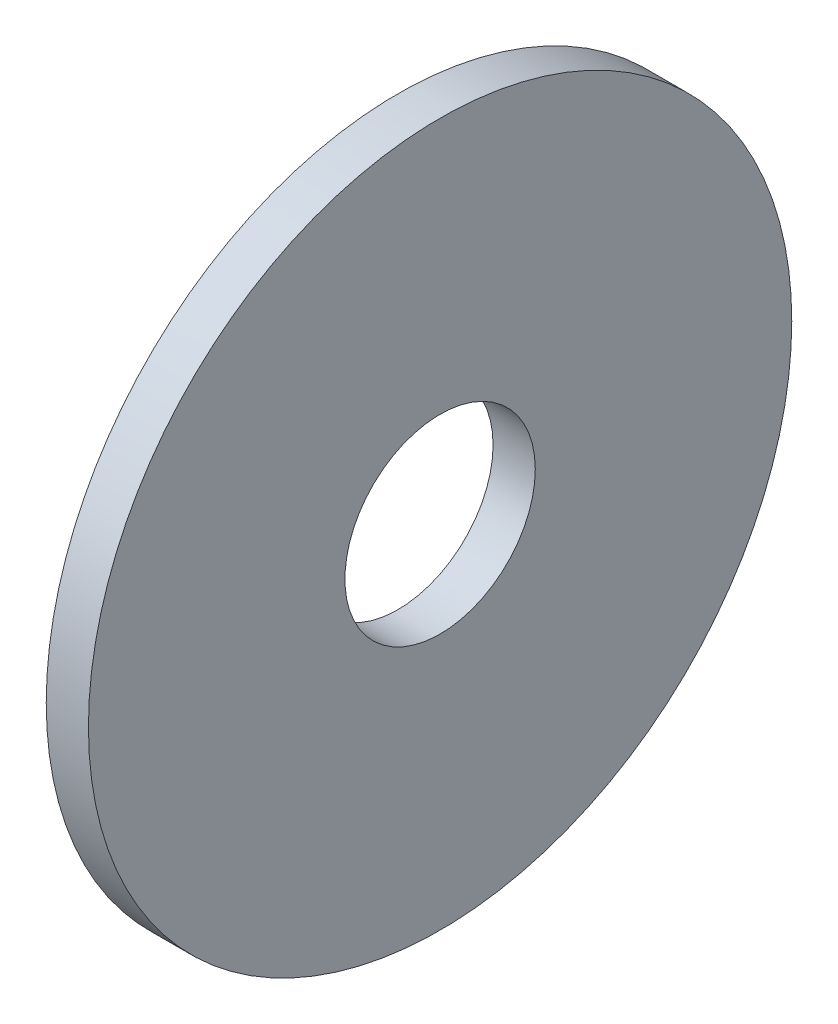
ISO-10303-21;
HEADER;
FILE_DESCRIPTION(('STEP AP214'),'2;1');
FILE_NAME('part.step','',(''),(''),'','','');
FILE_SCHEMA(('AUTOMOTIVE_DESIGN { 1 0 10303 214 1 1 1 1 }'));
ENDSEC;
DATA;
#1=APPLICATION_CONTEXT('core data for automotive mechanical design processes');
#2=APPLICATION_PROTOCOL_DEFINITION('international standard','automotive_design',2000,#1);
#3=PRODUCT_CONTEXT('',#1,'mechanical');
#4=PRODUCT('Part','Part','',(#3));
#5=PRODUCT_RELATED_PRODUCT_CATEGORY('part','',(#4));
#6=PRODUCT_DEFINITION_FORMATION('','',#4);
#7=PRODUCT_DEFINITION_CONTEXT('part definition',#1,'design');
#8=PRODUCT_DEFINITION('design','',#6,#7);
#9=PRODUCT_DEFINITION_SHAPE('','',#8);
#10=(LENGTH_UNIT() NAMED_UNIT(*) SI_UNIT(.MILLI.,.METRE.));
#11=(NAMED_UNIT(*) PLANE_ANGLE_UNIT() SI_UNIT($,.RADIAN.));
#12=(NAMED_UNIT(*) SI_UNIT($,.STERADIAN.) SOLID_ANGLE_UNIT());
#13=UNCERTAINTY_MEASURE_WITH_UNIT(LENGTH_MEASURE(1.E-05),#10,'distance_accuracy_value','');
#14=(GEOMETRIC_REPRESENTATION_CONTEXT(3) GLOBAL_UNCERTAINTY_ASSIGNED_CONTEXT((#13)) GLOBAL_UNIT_ASSIGNED_CONTEXT((#10,
#11,#12)) REPRESENTATION_CONTEXT('',''));
#15=CARTESIAN_POINT('',(0.,0.,0.));
#16=DIRECTION('',(0.,0.,1.));
#17=DIRECTION('',(1.,0.,0.));
#18=AXIS2_PLACEMENT_3D('',#15,#16,#17);
#19=CARTESIAN_POINT('',(1.143,0.,0.));
#20=DIRECTION('',(1.,0.,0.));
#21=DIRECTION('',(0.,0.,-1.));
#22=AXIS2_PLACEMENT_3D('',#19,#20,#21);
#23=PLANE('',#22);
#24=CARTESIAN_POINT('',(1.143,0.,0.));
#25=DIRECTION('',(1.,0.,0.));
#26=DIRECTION('',(0.,0.,-1.));
#27=AXIS2_PLACEMENT_3D('',#24,#25,#26);
#28=CIRCLE('',#27,9.525);
#29=CARTESIAN_POINT('',(1.143,0.,-9.525));
#30=VERTEX_POINT('',#29);
#31=EDGE_CURVE('E10',#30,#30,#28,.T.);
#32=ORIENTED_EDGE('',*,*,#31,.T.);
#33=EDGE_LOOP('',(#32));
#34=FACE_BOUND('',#33,.T.);
#35=CARTESIAN_POINT('',(1.143,0.,0.));
#36=DIRECTION('',(1.,0.,0.));
#37=DIRECTION('',(0.,0.,-1.));
#38=AXIS2_PLACEMENT_3D('',#35,#36,#37);
#39=CIRCLE('',#38,2.5781);
#40=CARTESIAN_POINT('',(1.143,0.,-2.5781));
#41=VERTEX_POINT('',#40);
#42=EDGE_CURVE('E41',#41,#41,#39,.T.);
#43=ORIENTED_EDGE('',*,*,#42,.F.);
#44=EDGE_LOOP('',(#43));
#45=FACE_BOUND('',#44,.T.);
#46=ADVANCED_FACE('F30',(#34,#45),#23,.T.);
#47=CARTESIAN_POINT('',(0.,0.,0.));
#48=DIRECTION('',(1.,0.,0.));
#49=DIRECTION('',(0.,0.,-1.));
#50=AXIS2_PLACEMENT_3D('',#47,#48,#49);
#51=PLANE('',#50);
#52=CARTESIAN_POINT('',(0.,0.,0.));
#53=DIRECTION('',(1.,0.,0.));
#54=DIRECTION('',(0.,0.,-1.));
#55=AXIS2_PLACEMENT_3D('',#52,#53,#54);
#56=CIRCLE('',#55,9.525);
#57=CARTESIAN_POINT('',(0.,0.,-9.525));
#58=VERTEX_POINT('',#57);
#59=EDGE_CURVE('E34',#58,#58,#56,.T.);
#60=ORIENTED_EDGE('',*,*,#59,.F.);
#61=EDGE_LOOP('',(#60));
#62=FACE_BOUND('',#61,.T.);
#63=CARTESIAN_POINT('',(0.,0.,0.));
#64=DIRECTION('',(1.,0.,0.));
#65=DIRECTION('',(0.,0.,-1.));
#66=AXIS2_PLACEMENT_3D('',#63,#64,#65);
#67=CIRCLE('',#66,2.5781);
#68=CARTESIAN_POINT('',(0.,0.,-2.5781));
#69=VERTEX_POINT('',#68);
#70=EDGE_CURVE('E43',#69,#69,#67,.T.);
#71=ORIENTED_EDGE('',*,*,#70,.T.);
#72=EDGE_LOOP('',(#71));
#73=FACE_BOUND('',#72,.T.);
#74=ADVANCED_FACE('F53',(#62,#73),#51,.F.);
#75=CARTESIAN_POINT('',(1.143,0.,0.));
#76=DIRECTION('',(-1.,0.,0.));
#77=DIRECTION('',(0.,0.,1.));
#78=AXIS2_PLACEMENT_3D('',#75,#76,#77);
#79=CYLINDRICAL_SURFACE('',#78,9.525);
#80=ORIENTED_EDGE('',*,*,#31,.F.);
#81=EDGE_LOOP('',(#80));
#82=FACE_BOUND('',#81,.T.);
#83=ORIENTED_EDGE('',*,*,#59,.T.);
#84=EDGE_LOOP('',(#83));
#85=FACE_BOUND('',#84,.T.);
#86=ADVANCED_FACE('F32',(#82,#85),#79,.T.);
#87=CARTESIAN_POINT('',(1.143,0.,0.));
#88=DIRECTION('',(-1.,0.,0.));
#89=DIRECTION('',(0.,0.,1.));
#90=AXIS2_PLACEMENT_3D('',#87,#88,#89);
#91=CYLINDRICAL_SURFACE('',#90,2.5781);
#92=ORIENTED_EDGE('',*,*,#42,.T.);
#93=EDGE_LOOP('',(#92));
#94=FACE_BOUND('',#93,.T.);
#95=ORIENTED_EDGE('',*,*,#70,.F.);
#96=EDGE_LOOP('',(#95));
#97=FACE_BOUND('',#96,.T.);
#98=ADVANCED_FACE('F49',(#94,#97),#91,.F.);
#99=CLOSED_SHELL('',(#46,#74,#86,#98));
#100=MANIFOLD_SOLID_BREP('B2',#99);
#101=ADVANCED_BREP_SHAPE_REPRESENTATION('',(#18,#100),#14);
#102=SHAPE_DEFINITION_REPRESENTATION(#9,#101);
ENDSEC;
END-ISO-10303-21;
